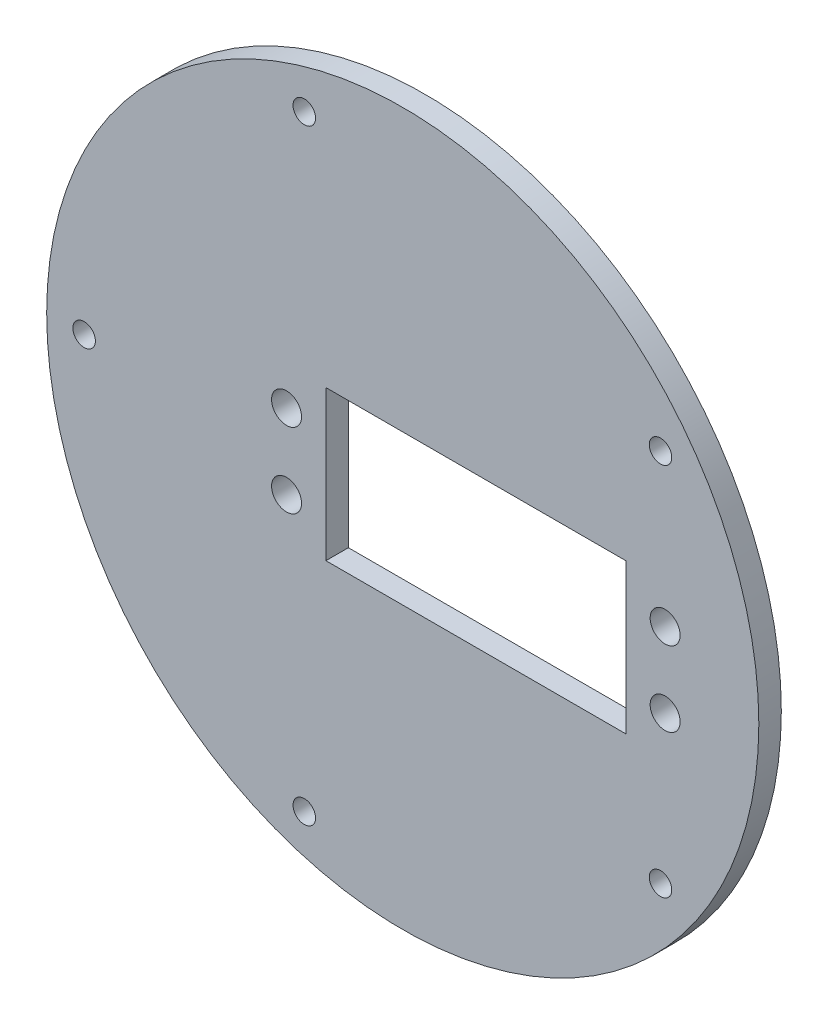
ISO-10303-21;
HEADER;
FILE_DESCRIPTION(('STEP AP214'),'2;1');
FILE_NAME('part.step','',(''),(''),'','','');
FILE_SCHEMA(('AUTOMOTIVE_DESIGN { 1 0 10303 214 1 1 1 1 }'));
ENDSEC;
DATA;
#1=APPLICATION_CONTEXT('core data for automotive mechanical design processes');
#2=APPLICATION_PROTOCOL_DEFINITION('international standard','automotive_design',2000,#1);
#3=PRODUCT_CONTEXT('',#1,'mechanical');
#4=PRODUCT('Part','Part','',(#3));
#5=PRODUCT_RELATED_PRODUCT_CATEGORY('part','',(#4));
#6=PRODUCT_DEFINITION_FORMATION('','',#4);
#7=PRODUCT_DEFINITION_CONTEXT('part definition',#1,'design');
#8=PRODUCT_DEFINITION('design','',#6,#7);
#9=PRODUCT_DEFINITION_SHAPE('','',#8);
#10=(LENGTH_UNIT() NAMED_UNIT(*) SI_UNIT(.MILLI.,.METRE.));
#11=(NAMED_UNIT(*) PLANE_ANGLE_UNIT() SI_UNIT($,.RADIAN.));
#12=(NAMED_UNIT(*) SI_UNIT($,.STERADIAN.) SOLID_ANGLE_UNIT());
#13=UNCERTAINTY_MEASURE_WITH_UNIT(LENGTH_MEASURE(1.E-05),#10,'distance_accuracy_value','');
#14=(GEOMETRIC_REPRESENTATION_CONTEXT(3) GLOBAL_UNCERTAINTY_ASSIGNED_CONTEXT((#13)) GLOBAL_UNIT_ASSIGNED_CONTEXT((#10,
#11,#12)) REPRESENTATION_CONTEXT('',''));
#15=CARTESIAN_POINT('',(0.,0.,0.));
#16=DIRECTION('',(0.,0.,1.));
#17=DIRECTION('',(1.,0.,0.));
#18=AXIS2_PLACEMENT_3D('',#15,#16,#17);
#19=CARTESIAN_POINT('',(0.,0.,3.));
#20=DIRECTION('',(0.,0.,-1.));
#21=DIRECTION('',(-1.,0.,0.));
#22=AXIS2_PLACEMENT_3D('',#19,#20,#21);
#23=CYLINDRICAL_SURFACE('',#22,47.5);
#24=CARTESIAN_POINT('',(0.,0.,3.));
#25=DIRECTION('',(0.,0.,1.));
#26=DIRECTION('',(1.,0.,0.));
#27=AXIS2_PLACEMENT_3D('',#24,#25,#26);
#28=CIRCLE('',#27,47.5);
#29=CARTESIAN_POINT('',(47.5,0.,3.));
#30=VERTEX_POINT('',#29);
#31=EDGE_CURVE('E11',#30,#30,#28,.T.);
#32=ORIENTED_EDGE('',*,*,#31,.F.);
#33=EDGE_LOOP('',(#32));
#34=FACE_BOUND('',#33,.T.);
#35=CARTESIAN_POINT('',(0.,0.,0.));
#36=DIRECTION('',(0.,0.,1.));
#37=DIRECTION('',(1.,0.,0.));
#38=AXIS2_PLACEMENT_3D('',#35,#36,#37);
#39=CIRCLE('',#38,47.5);
#40=CARTESIAN_POINT('',(47.5,0.,0.));
#41=VERTEX_POINT('',#40);
#42=EDGE_CURVE('E42',#41,#41,#39,.T.);
#43=ORIENTED_EDGE('',*,*,#42,.T.);
#44=EDGE_LOOP('',(#43));
#45=FACE_BOUND('',#44,.T.);
#46=ADVANCED_FACE('F39',(#34,#45),#23,.T.);
#47=CARTESIAN_POINT('',(0.,0.,3.));
#48=DIRECTION('',(0.,0.,1.));
#49=DIRECTION('',(1.,0.,0.));
#50=AXIS2_PLACEMENT_3D('',#47,#48,#49);
#51=PLANE('',#50);
#52=CARTESIAN_POINT('',(-42.5,0.,3.));
#53=DIRECTION('',(0.,0.,1.));
#54=DIRECTION('',(1.,0.,0.));
#55=AXIS2_PLACEMENT_3D('',#52,#53,#54);
#56=CIRCLE('',#55,1.5);
#57=CARTESIAN_POINT('',(-41.,0.,3.));
#58=VERTEX_POINT('',#57);
#59=EDGE_CURVE('E209',#58,#58,#56,.T.);
#60=ORIENTED_EDGE('',*,*,#59,.F.);
#61=EDGE_LOOP('',(#60));
#62=FACE_BOUND('',#61,.T.);
#63=CARTESIAN_POINT('',(-13.1332222609352,40.4199019425441,3.));
#64=DIRECTION('',(0.,0.,1.));
#65=DIRECTION('',(1.,0.,0.));
#66=AXIS2_PLACEMENT_3D('',#63,#64,#65);
#67=CIRCLE('',#66,1.5);
#68=CARTESIAN_POINT('',(-11.6332222609352,40.4199019425441,3.));
#69=VERTEX_POINT('',#68);
#70=EDGE_CURVE('E220',#69,#69,#67,.T.);
#71=ORIENTED_EDGE('',*,*,#70,.F.);
#72=EDGE_LOOP('',(#71));
#73=FACE_BOUND('',#72,.T.);
#74=CARTESIAN_POINT('',(34.3832222609354,24.9808732224299,3.));
#75=DIRECTION('',(0.,0.,1.));
#76=DIRECTION('',(1.,0.,0.));
#77=AXIS2_PLACEMENT_3D('',#74,#75,#76);
#78=CIRCLE('',#77,1.50000000000001);
#79=CARTESIAN_POINT('',(35.8832222609354,24.9808732224299,3.));
#80=VERTEX_POINT('',#79);
#81=EDGE_CURVE('E228',#80,#80,#78,.T.);
#82=ORIENTED_EDGE('',*,*,#81,.F.);
#83=EDGE_LOOP('',(#82));
#84=FACE_BOUND('',#83,.T.);
#85=CARTESIAN_POINT('',(34.3832222609351,-24.9808732224304,3.));
#86=DIRECTION('',(0.,0.,1.));
#87=DIRECTION('',(1.,0.,0.));
#88=AXIS2_PLACEMENT_3D('',#85,#86,#87);
#89=CIRCLE('',#88,1.50000000000001);
#90=CARTESIAN_POINT('',(35.8832222609351,-24.9808732224304,3.));
#91=VERTEX_POINT('',#90);
#92=EDGE_CURVE('E236',#91,#91,#89,.T.);
#93=ORIENTED_EDGE('',*,*,#92,.F.);
#94=EDGE_LOOP('',(#93));
#95=FACE_BOUND('',#94,.T.);
#96=CARTESIAN_POINT('',(-13.1332222609357,-40.4199019425439,3.));
#97=DIRECTION('',(0.,0.,1.));
#98=DIRECTION('',(1.,0.,0.));
#99=AXIS2_PLACEMENT_3D('',#96,#97,#98);
#100=CIRCLE('',#99,1.5);
#101=CARTESIAN_POINT('',(-11.6332222609357,-40.4199019425439,3.));
#102=VERTEX_POINT('',#101);
#103=EDGE_CURVE('E244',#102,#102,#100,.T.);
#104=ORIENTED_EDGE('',*,*,#103,.F.);
#105=EDGE_LOOP('',(#104));
#106=FACE_BOUND('',#105,.T.);
#107=CARTESIAN_POINT('',(-15.4999999999999,4.99999999999998,3.));
#108=DIRECTION('',(0.,0.,1.));
#109=DIRECTION('',(1.,0.,0.));
#110=AXIS2_PLACEMENT_3D('',#107,#108,#109);
#111=CIRCLE('',#110,2.);
#112=CARTESIAN_POINT('',(-13.4999999999999,4.99999999999998,3.));
#113=VERTEX_POINT('',#112);
#114=EDGE_CURVE('E108',#113,#113,#111,.T.);
#115=ORIENTED_EDGE('',*,*,#114,.F.);
#116=EDGE_LOOP('',(#115));
#117=FACE_BOUND('',#116,.T.);
#118=CARTESIAN_POINT('',(-15.4999999999999,-5.00000000000002,3.));
#119=DIRECTION('',(0.,0.,1.));
#120=DIRECTION('',(1.,0.,0.));
#121=AXIS2_PLACEMENT_3D('',#118,#119,#120);
#122=CIRCLE('',#121,2.);
#123=CARTESIAN_POINT('',(-13.4999999999999,-5.00000000000002,3.));
#124=VERTEX_POINT('',#123);
#125=EDGE_CURVE('E208',#124,#124,#122,.T.);
#126=ORIENTED_EDGE('',*,*,#125,.F.);
#127=EDGE_LOOP('',(#126));
#128=FACE_BOUND('',#127,.T.);
#129=CARTESIAN_POINT('',(35.0000000000001,4.99999999999998,3.));
#130=DIRECTION('',(0.,0.,1.));
#131=DIRECTION('',(1.,0.,0.));
#132=AXIS2_PLACEMENT_3D('',#129,#130,#131);
#133=CIRCLE('',#132,2.00000000000001);
#134=CARTESIAN_POINT('',(37.0000000000001,4.99999999999998,3.));
#135=VERTEX_POINT('',#134);
#136=EDGE_CURVE('E259',#135,#135,#133,.T.);
#137=ORIENTED_EDGE('',*,*,#136,.F.);
#138=EDGE_LOOP('',(#137));
#139=FACE_BOUND('',#138,.T.);
#140=CARTESIAN_POINT('',(35.0000000000001,-5.00000000000002,3.));
#141=DIRECTION('',(0.,0.,1.));
#142=DIRECTION('',(1.,0.,0.));
#143=AXIS2_PLACEMENT_3D('',#140,#141,#142);
#144=CIRCLE('',#143,2.00000000000001);
#145=CARTESIAN_POINT('',(37.0000000000001,-5.00000000000002,3.));
#146=VERTEX_POINT('',#145);
#147=EDGE_CURVE('E251',#146,#146,#144,.T.);
#148=ORIENTED_EDGE('',*,*,#147,.F.);
#149=EDGE_LOOP('',(#148));
#150=FACE_BOUND('',#149,.T.);
#151=DIRECTION('',(0.,-1.,0.));
#152=VECTOR('',#151,1.);
#153=CARTESIAN_POINT('',(-10.25,-9.99999999999998,3.));
#154=LINE('',#153,#152);
#155=CARTESIAN_POINT('',(-10.25,9.99999999999997,3.));
#156=VERTEX_POINT('',#155);
#157=CARTESIAN_POINT('',(-10.25,-9.99999999999998,3.));
#158=VERTEX_POINT('',#157);
#159=EDGE_CURVE('E54',#156,#158,#154,.T.);
#160=ORIENTED_EDGE('',*,*,#159,.F.);
#161=DIRECTION('',(-1.,0.,0.));
#162=VECTOR('',#161,1.);
#163=CARTESIAN_POINT('',(29.75,9.99999999999997,3.));
#164=LINE('',#163,#162);
#165=CARTESIAN_POINT('',(29.75,9.99999999999997,3.));
#166=VERTEX_POINT('',#165);
#167=EDGE_CURVE('E101',#166,#156,#164,.T.);
#168=ORIENTED_EDGE('',*,*,#167,.F.);
#169=DIRECTION('',(0.,1.,0.));
#170=VECTOR('',#169,1.);
#171=CARTESIAN_POINT('',(29.75,-9.99999999999998,3.));
#172=LINE('',#171,#170);
#173=CARTESIAN_POINT('',(29.75,-9.99999999999998,3.));
#174=VERTEX_POINT('',#173);
#175=EDGE_CURVE('E105',#174,#166,#172,.T.);
#176=ORIENTED_EDGE('',*,*,#175,.F.);
#177=DIRECTION('',(1.,0.,0.));
#178=VECTOR('',#177,1.);
#179=CARTESIAN_POINT('',(29.75,-9.99999999999998,3.));
#180=LINE('',#179,#178);
#181=EDGE_CURVE('E117',#158,#174,#180,.T.);
#182=ORIENTED_EDGE('',*,*,#181,.F.);
#183=EDGE_LOOP('',(#160,#168,#176,#182));
#184=FACE_BOUND('',#183,.T.);
#185=ORIENTED_EDGE('',*,*,#31,.T.);
#186=EDGE_LOOP('',(#185));
#187=FACE_BOUND('',#186,.T.);
#188=ADVANCED_FACE('F135',(#62,#73,#84,#95,#106,#117,#128,#139,#150,#184,#187),#51,.T.);
#189=CARTESIAN_POINT('',(0.,0.,0.));
#190=DIRECTION('',(0.,0.,1.));
#191=DIRECTION('',(1.,0.,0.));
#192=AXIS2_PLACEMENT_3D('',#189,#190,#191);
#193=PLANE('',#192);
#194=CARTESIAN_POINT('',(-42.5,0.,0.));
#195=DIRECTION('',(0.,0.,1.));
#196=DIRECTION('',(1.,0.,0.));
#197=AXIS2_PLACEMENT_3D('',#194,#195,#196);
#198=CIRCLE('',#197,1.5);
#199=CARTESIAN_POINT('',(-41.,0.,0.));
#200=VERTEX_POINT('',#199);
#201=EDGE_CURVE('E205',#200,#200,#198,.T.);
#202=ORIENTED_EDGE('',*,*,#201,.T.);
#203=EDGE_LOOP('',(#202));
#204=FACE_BOUND('',#203,.T.);
#205=CARTESIAN_POINT('',(-13.1332222609352,40.4199019425441,0.));
#206=DIRECTION('',(0.,0.,1.));
#207=DIRECTION('',(1.,0.,0.));
#208=AXIS2_PLACEMENT_3D('',#205,#206,#207);
#209=CIRCLE('',#208,1.5);
#210=CARTESIAN_POINT('',(-11.6332222609352,40.4199019425441,0.));
#211=VERTEX_POINT('',#210);
#212=EDGE_CURVE('E214',#211,#211,#209,.T.);
#213=ORIENTED_EDGE('',*,*,#212,.T.);
#214=EDGE_LOOP('',(#213));
#215=FACE_BOUND('',#214,.T.);
#216=CARTESIAN_POINT('',(34.3832222609354,24.9808732224299,0.));
#217=DIRECTION('',(0.,0.,1.));
#218=DIRECTION('',(1.,0.,0.));
#219=AXIS2_PLACEMENT_3D('',#216,#217,#218);
#220=CIRCLE('',#219,1.50000000000001);
#221=CARTESIAN_POINT('',(35.8832222609354,24.9808732224299,0.));
#222=VERTEX_POINT('',#221);
#223=EDGE_CURVE('E224',#222,#222,#220,.T.);
#224=ORIENTED_EDGE('',*,*,#223,.T.);
#225=EDGE_LOOP('',(#224));
#226=FACE_BOUND('',#225,.T.);
#227=CARTESIAN_POINT('',(34.3832222609351,-24.9808732224304,0.));
#228=DIRECTION('',(0.,0.,1.));
#229=DIRECTION('',(1.,0.,0.));
#230=AXIS2_PLACEMENT_3D('',#227,#228,#229);
#231=CIRCLE('',#230,1.50000000000001);
#232=CARTESIAN_POINT('',(35.8832222609351,-24.9808732224304,0.));
#233=VERTEX_POINT('',#232);
#234=EDGE_CURVE('E232',#233,#233,#231,.T.);
#235=ORIENTED_EDGE('',*,*,#234,.T.);
#236=EDGE_LOOP('',(#235));
#237=FACE_BOUND('',#236,.T.);
#238=CARTESIAN_POINT('',(-13.1332222609357,-40.4199019425439,0.));
#239=DIRECTION('',(0.,0.,1.));
#240=DIRECTION('',(1.,0.,0.));
#241=AXIS2_PLACEMENT_3D('',#238,#239,#240);
#242=CIRCLE('',#241,1.5);
#243=CARTESIAN_POINT('',(-11.6332222609357,-40.4199019425439,0.));
#244=VERTEX_POINT('',#243);
#245=EDGE_CURVE('E240',#244,#244,#242,.T.);
#246=ORIENTED_EDGE('',*,*,#245,.T.);
#247=EDGE_LOOP('',(#246));
#248=FACE_BOUND('',#247,.T.);
#249=CARTESIAN_POINT('',(-15.4999999999999,4.99999999999998,0.));
#250=DIRECTION('',(0.,0.,1.));
#251=DIRECTION('',(1.,0.,0.));
#252=AXIS2_PLACEMENT_3D('',#249,#250,#251);
#253=CIRCLE('',#252,2.);
#254=CARTESIAN_POINT('',(-13.4999999999999,4.99999999999998,0.));
#255=VERTEX_POINT('',#254);
#256=EDGE_CURVE('E200',#255,#255,#253,.T.);
#257=ORIENTED_EDGE('',*,*,#256,.T.);
#258=EDGE_LOOP('',(#257));
#259=FACE_BOUND('',#258,.T.);
#260=CARTESIAN_POINT('',(-15.4999999999999,-5.00000000000002,0.));
#261=DIRECTION('',(0.,0.,1.));
#262=DIRECTION('',(1.,0.,0.));
#263=AXIS2_PLACEMENT_3D('',#260,#261,#262);
#264=CIRCLE('',#263,2.);
#265=CARTESIAN_POINT('',(-13.4999999999999,-5.00000000000002,0.));
#266=VERTEX_POINT('',#265);
#267=EDGE_CURVE('E263',#266,#266,#264,.T.);
#268=ORIENTED_EDGE('',*,*,#267,.T.);
#269=EDGE_LOOP('',(#268));
#270=FACE_BOUND('',#269,.T.);
#271=CARTESIAN_POINT('',(35.0000000000001,4.99999999999998,0.));
#272=DIRECTION('',(0.,0.,1.));
#273=DIRECTION('',(1.,0.,0.));
#274=AXIS2_PLACEMENT_3D('',#271,#272,#273);
#275=CIRCLE('',#274,2.00000000000001);
#276=CARTESIAN_POINT('',(37.0000000000001,4.99999999999998,0.));
#277=VERTEX_POINT('',#276);
#278=EDGE_CURVE('E255',#277,#277,#275,.T.);
#279=ORIENTED_EDGE('',*,*,#278,.T.);
#280=EDGE_LOOP('',(#279));
#281=FACE_BOUND('',#280,.T.);
#282=CARTESIAN_POINT('',(35.0000000000001,-5.00000000000002,0.));
#283=DIRECTION('',(0.,0.,1.));
#284=DIRECTION('',(1.,0.,0.));
#285=AXIS2_PLACEMENT_3D('',#282,#283,#284);
#286=CIRCLE('',#285,2.00000000000001);
#287=CARTESIAN_POINT('',(37.0000000000001,-5.00000000000002,0.));
#288=VERTEX_POINT('',#287);
#289=EDGE_CURVE('E118',#288,#288,#286,.T.);
#290=ORIENTED_EDGE('',*,*,#289,.T.);
#291=EDGE_LOOP('',(#290));
#292=FACE_BOUND('',#291,.T.);
#293=DIRECTION('',(-1.,0.,0.));
#294=VECTOR('',#293,1.);
#295=CARTESIAN_POINT('',(29.75,9.99999999999997,0.));
#296=LINE('',#295,#294);
#297=CARTESIAN_POINT('',(29.75,9.99999999999997,0.));
#298=VERTEX_POINT('',#297);
#299=CARTESIAN_POINT('',(-10.25,9.99999999999997,0.));
#300=VERTEX_POINT('',#299);
#301=EDGE_CURVE('E89',#298,#300,#296,.T.);
#302=ORIENTED_EDGE('',*,*,#301,.T.);
#303=DIRECTION('',(0.,-1.,0.));
#304=VECTOR('',#303,1.);
#305=CARTESIAN_POINT('',(-10.25,-9.99999999999998,0.));
#306=LINE('',#305,#304);
#307=CARTESIAN_POINT('',(-10.25,-9.99999999999998,0.));
#308=VERTEX_POINT('',#307);
#309=EDGE_CURVE('E82',#300,#308,#306,.T.);
#310=ORIENTED_EDGE('',*,*,#309,.T.);
#311=DIRECTION('',(1.,0.,0.));
#312=VECTOR('',#311,1.);
#313=CARTESIAN_POINT('',(29.75,-9.99999999999998,0.));
#314=LINE('',#313,#312);
#315=CARTESIAN_POINT('',(29.75,-9.99999999999998,0.));
#316=VERTEX_POINT('',#315);
#317=EDGE_CURVE('E92',#308,#316,#314,.T.);
#318=ORIENTED_EDGE('',*,*,#317,.T.);
#319=DIRECTION('',(0.,1.,0.));
#320=VECTOR('',#319,1.);
#321=CARTESIAN_POINT('',(29.75,-9.99999999999998,0.));
#322=LINE('',#321,#320);
#323=EDGE_CURVE('E62',#316,#298,#322,.T.);
#324=ORIENTED_EDGE('',*,*,#323,.T.);
#325=EDGE_LOOP('',(#302,#310,#318,#324));
#326=FACE_BOUND('',#325,.T.);
#327=ORIENTED_EDGE('',*,*,#42,.F.);
#328=EDGE_LOOP('',(#327));
#329=FACE_BOUND('',#328,.T.);
#330=ADVANCED_FACE('F97',(#204,#215,#226,#237,#248,#259,#270,#281,#292,#326,#329),#193,.F.);
#331=CARTESIAN_POINT('',(-10.25,-9.99999999999998,0.));
#332=DIRECTION('',(-1.,0.,0.));
#333=DIRECTION('',(0.,0.,1.));
#334=AXIS2_PLACEMENT_3D('',#331,#332,#333);
#335=PLANE('',#334);
#336=ORIENTED_EDGE('',*,*,#159,.T.);
#337=DIRECTION('',(0.,0.,1.));
#338=VECTOR('',#337,1.);
#339=CARTESIAN_POINT('',(-10.25,-9.99999999999998,0.));
#340=LINE('',#339,#338);
#341=EDGE_CURVE('E78',#308,#158,#340,.T.);
#342=ORIENTED_EDGE('',*,*,#341,.F.);
#343=ORIENTED_EDGE('',*,*,#309,.F.);
#344=DIRECTION('',(0.,0.,1.));
#345=VECTOR('',#344,1.);
#346=CARTESIAN_POINT('',(-10.25,9.99999999999997,0.));
#347=LINE('',#346,#345);
#348=EDGE_CURVE('E124',#300,#156,#347,.T.);
#349=ORIENTED_EDGE('',*,*,#348,.T.);
#350=EDGE_LOOP('',(#336,#342,#343,#349));
#351=FACE_BOUND('',#350,.T.);
#352=ADVANCED_FACE('F80',(#351),#335,.F.);
#353=CARTESIAN_POINT('',(29.75,9.99999999999997,0.));
#354=DIRECTION('',(0.,1.,0.));
#355=DIRECTION('',(0.,0.,1.));
#356=AXIS2_PLACEMENT_3D('',#353,#354,#355);
#357=PLANE('',#356);
#358=ORIENTED_EDGE('',*,*,#167,.T.);
#359=ORIENTED_EDGE('',*,*,#348,.F.);
#360=ORIENTED_EDGE('',*,*,#301,.F.);
#361=DIRECTION('',(0.,0.,1.));
#362=VECTOR('',#361,1.);
#363=CARTESIAN_POINT('',(29.75,9.99999999999997,0.));
#364=LINE('',#363,#362);
#365=EDGE_CURVE('E127',#298,#166,#364,.T.);
#366=ORIENTED_EDGE('',*,*,#365,.T.);
#367=EDGE_LOOP('',(#358,#359,#360,#366));
#368=FACE_BOUND('',#367,.T.);
#369=ADVANCED_FACE('F138',(#368),#357,.F.);
#370=CARTESIAN_POINT('',(29.75,-9.99999999999998,0.));
#371=DIRECTION('',(1.,0.,0.));
#372=DIRECTION('',(0.,0.,-1.));
#373=AXIS2_PLACEMENT_3D('',#370,#371,#372);
#374=PLANE('',#373);
#375=ORIENTED_EDGE('',*,*,#175,.T.);
#376=ORIENTED_EDGE('',*,*,#365,.F.);
#377=ORIENTED_EDGE('',*,*,#323,.F.);
#378=DIRECTION('',(0.,0.,1.));
#379=VECTOR('',#378,1.);
#380=CARTESIAN_POINT('',(29.75,-9.99999999999998,0.));
#381=LINE('',#380,#379);
#382=EDGE_CURVE('E88',#316,#174,#381,.T.);
#383=ORIENTED_EDGE('',*,*,#382,.T.);
#384=EDGE_LOOP('',(#375,#376,#377,#383));
#385=FACE_BOUND('',#384,.T.);
#386=ADVANCED_FACE('F131',(#385),#374,.F.);
#387=CARTESIAN_POINT('',(29.75,-9.99999999999998,0.));
#388=DIRECTION('',(0.,-1.,0.));
#389=DIRECTION('',(0.,0.,-1.));
#390=AXIS2_PLACEMENT_3D('',#387,#388,#389);
#391=PLANE('',#390);
#392=ORIENTED_EDGE('',*,*,#181,.T.);
#393=ORIENTED_EDGE('',*,*,#382,.F.);
#394=ORIENTED_EDGE('',*,*,#317,.F.);
#395=ORIENTED_EDGE('',*,*,#341,.T.);
#396=EDGE_LOOP('',(#392,#393,#394,#395));
#397=FACE_BOUND('',#396,.T.);
#398=ADVANCED_FACE('F93',(#397),#391,.F.);
#399=CARTESIAN_POINT('',(35.0000000000001,-5.00000000000002,0.));
#400=DIRECTION('',(0.,0.,1.));
#401=DIRECTION('',(1.,0.,0.));
#402=AXIS2_PLACEMENT_3D('',#399,#400,#401);
#403=CYLINDRICAL_SURFACE('',#402,2.00000000000001);
#404=ORIENTED_EDGE('',*,*,#289,.F.);
#405=EDGE_LOOP('',(#404));
#406=FACE_BOUND('',#405,.T.);
#407=ORIENTED_EDGE('',*,*,#147,.T.);
#408=EDGE_LOOP('',(#407));
#409=FACE_BOUND('',#408,.T.);
#410=ADVANCED_FACE('F168',(#406,#409),#403,.F.);
#411=CARTESIAN_POINT('',(35.0000000000001,4.99999999999998,0.));
#412=DIRECTION('',(0.,0.,1.));
#413=DIRECTION('',(1.,0.,0.));
#414=AXIS2_PLACEMENT_3D('',#411,#412,#413);
#415=CYLINDRICAL_SURFACE('',#414,2.00000000000001);
#416=ORIENTED_EDGE('',*,*,#278,.F.);
#417=EDGE_LOOP('',(#416));
#418=FACE_BOUND('',#417,.T.);
#419=ORIENTED_EDGE('',*,*,#136,.T.);
#420=EDGE_LOOP('',(#419));
#421=FACE_BOUND('',#420,.T.);
#422=ADVANCED_FACE('F172',(#418,#421),#415,.F.);
#423=CARTESIAN_POINT('',(-15.4999999999999,-5.00000000000002,0.));
#424=DIRECTION('',(0.,0.,1.));
#425=DIRECTION('',(1.,0.,0.));
#426=AXIS2_PLACEMENT_3D('',#423,#424,#425);
#427=CYLINDRICAL_SURFACE('',#426,2.);
#428=ORIENTED_EDGE('',*,*,#267,.F.);
#429=EDGE_LOOP('',(#428));
#430=FACE_BOUND('',#429,.T.);
#431=ORIENTED_EDGE('',*,*,#125,.T.);
#432=EDGE_LOOP('',(#431));
#433=FACE_BOUND('',#432,.T.);
#434=ADVANCED_FACE('F178',(#430,#433),#427,.F.);
#435=CARTESIAN_POINT('',(-15.4999999999999,4.99999999999998,0.));
#436=DIRECTION('',(0.,0.,1.));
#437=DIRECTION('',(1.,0.,0.));
#438=AXIS2_PLACEMENT_3D('',#435,#436,#437);
#439=CYLINDRICAL_SURFACE('',#438,2.);
#440=ORIENTED_EDGE('',*,*,#256,.F.);
#441=EDGE_LOOP('',(#440));
#442=FACE_BOUND('',#441,.T.);
#443=ORIENTED_EDGE('',*,*,#114,.T.);
#444=EDGE_LOOP('',(#443));
#445=FACE_BOUND('',#444,.T.);
#446=ADVANCED_FACE('F188',(#442,#445),#439,.F.);
#447=CARTESIAN_POINT('',(-13.1332222609357,-40.4199019425439,0.));
#448=DIRECTION('',(0.,0.,1.));
#449=DIRECTION('',(1.,0.,0.));
#450=AXIS2_PLACEMENT_3D('',#447,#448,#449);
#451=CYLINDRICAL_SURFACE('',#450,1.5);
#452=ORIENTED_EDGE('',*,*,#245,.F.);
#453=EDGE_LOOP('',(#452));
#454=FACE_BOUND('',#453,.T.);
#455=ORIENTED_EDGE('',*,*,#103,.T.);
#456=EDGE_LOOP('',(#455));
#457=FACE_BOUND('',#456,.T.);
#458=ADVANCED_FACE('F184',(#454,#457),#451,.F.);
#459=CARTESIAN_POINT('',(34.3832222609351,-24.9808732224304,0.));
#460=DIRECTION('',(0.,0.,1.));
#461=DIRECTION('',(1.,0.,0.));
#462=AXIS2_PLACEMENT_3D('',#459,#460,#461);
#463=CYLINDRICAL_SURFACE('',#462,1.50000000000001);
#464=ORIENTED_EDGE('',*,*,#234,.F.);
#465=EDGE_LOOP('',(#464));
#466=FACE_BOUND('',#465,.T.);
#467=ORIENTED_EDGE('',*,*,#92,.T.);
#468=EDGE_LOOP('',(#467));
#469=FACE_BOUND('',#468,.T.);
#470=ADVANCED_FACE('F195',(#466,#469),#463,.F.);
#471=CARTESIAN_POINT('',(34.3832222609354,24.9808732224299,0.));
#472=DIRECTION('',(0.,0.,1.));
#473=DIRECTION('',(1.,0.,0.));
#474=AXIS2_PLACEMENT_3D('',#471,#472,#473);
#475=CYLINDRICAL_SURFACE('',#474,1.50000000000001);
#476=ORIENTED_EDGE('',*,*,#223,.F.);
#477=EDGE_LOOP('',(#476));
#478=FACE_BOUND('',#477,.T.);
#479=ORIENTED_EDGE('',*,*,#81,.T.);
#480=EDGE_LOOP('',(#479));
#481=FACE_BOUND('',#480,.T.);
#482=ADVANCED_FACE('F292',(#478,#481),#475,.F.);
#483=CARTESIAN_POINT('',(-13.1332222609352,40.4199019425441,0.));
#484=DIRECTION('',(0.,0.,1.));
#485=DIRECTION('',(1.,0.,0.));
#486=AXIS2_PLACEMENT_3D('',#483,#484,#485);
#487=CYLINDRICAL_SURFACE('',#486,1.5);
#488=ORIENTED_EDGE('',*,*,#212,.F.);
#489=EDGE_LOOP('',(#488));
#490=FACE_BOUND('',#489,.T.);
#491=ORIENTED_EDGE('',*,*,#70,.T.);
#492=EDGE_LOOP('',(#491));
#493=FACE_BOUND('',#492,.T.);
#494=ADVANCED_FACE('F297',(#490,#493),#487,.F.);
#495=CARTESIAN_POINT('',(-42.5,0.,0.));
#496=DIRECTION('',(0.,0.,1.));
#497=DIRECTION('',(1.,0.,0.));
#498=AXIS2_PLACEMENT_3D('',#495,#496,#497);
#499=CYLINDRICAL_SURFACE('',#498,1.5);
#500=ORIENTED_EDGE('',*,*,#201,.F.);
#501=EDGE_LOOP('',(#500));
#502=FACE_BOUND('',#501,.T.);
#503=ORIENTED_EDGE('',*,*,#59,.T.);
#504=EDGE_LOOP('',(#503));
#505=FACE_BOUND('',#504,.T.);
#506=ADVANCED_FACE('F304',(#502,#505),#499,.F.);
#507=CLOSED_SHELL('',(#46,#188,#330,#352,#369,#386,#398,#410,#422,#434,#446,#458,#470,#482,#494,#506));
#508=MANIFOLD_SOLID_BREP('B2',#507);
#509=ADVANCED_BREP_SHAPE_REPRESENTATION('',(#18,#508),#14);
#510=SHAPE_DEFINITION_REPRESENTATION(#9,#509);
ENDSEC;
END-ISO-10303-21;
